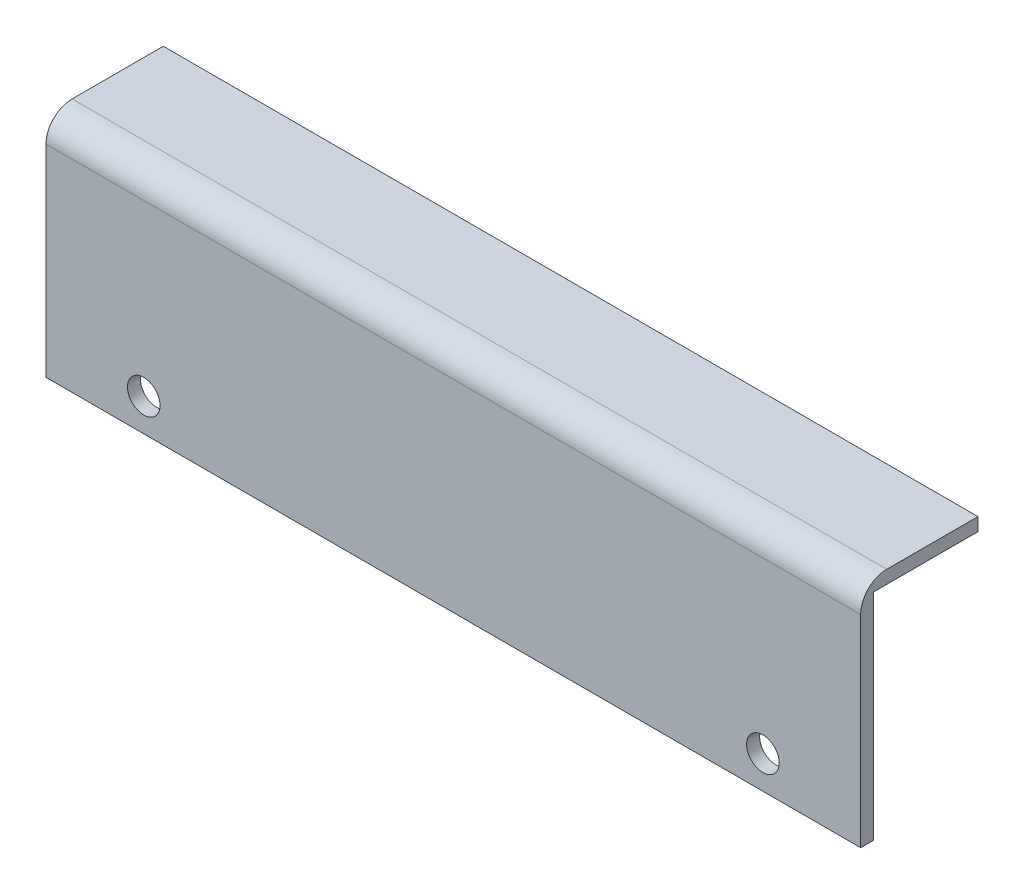
ISO-10303-21;
HEADER;
FILE_DESCRIPTION(('STEP AP214'),'2;1');
FILE_NAME('part.step','',(''),(''),'','','');
FILE_SCHEMA(('AUTOMOTIVE_DESIGN { 1 0 10303 214 1 1 1 1 }'));
ENDSEC;
DATA;
#1=APPLICATION_CONTEXT('core data for automotive mechanical design processes');
#2=APPLICATION_PROTOCOL_DEFINITION('international standard','automotive_design',2000,#1);
#3=PRODUCT_CONTEXT('',#1,'mechanical');
#4=PRODUCT('Part','Part','',(#3));
#5=PRODUCT_RELATED_PRODUCT_CATEGORY('part','',(#4));
#6=PRODUCT_DEFINITION_FORMATION('','',#4);
#7=PRODUCT_DEFINITION_CONTEXT('part definition',#1,'design');
#8=PRODUCT_DEFINITION('design','',#6,#7);
#9=PRODUCT_DEFINITION_SHAPE('','',#8);
#10=(LENGTH_UNIT() NAMED_UNIT(*) SI_UNIT(.MILLI.,.METRE.));
#11=(NAMED_UNIT(*) PLANE_ANGLE_UNIT() SI_UNIT($,.RADIAN.));
#12=(NAMED_UNIT(*) SI_UNIT($,.STERADIAN.) SOLID_ANGLE_UNIT());
#13=UNCERTAINTY_MEASURE_WITH_UNIT(LENGTH_MEASURE(1.E-05),#10,'distance_accuracy_value','');
#14=(GEOMETRIC_REPRESENTATION_CONTEXT(3) GLOBAL_UNCERTAINTY_ASSIGNED_CONTEXT((#13)) GLOBAL_UNIT_ASSIGNED_CONTEXT((#10,
#11,#12)) REPRESENTATION_CONTEXT('',''));
#15=CARTESIAN_POINT('',(0.,0.,0.));
#16=DIRECTION('',(0.,0.,1.));
#17=DIRECTION('',(1.,0.,0.));
#18=AXIS2_PLACEMENT_3D('',#15,#16,#17);
#19=CARTESIAN_POINT('',(125.,16.7867758305788,-1.14164631227231));
#20=DIRECTION('',(0.,0.,1.));
#21=DIRECTION('',(0.,-1.,0.));
#22=AXIS2_PLACEMENT_3D('',#19,#20,#21);
#23=PLANE('',#22);
#24=CARTESIAN_POINT('',(110.,-11.2132241694212,-1.14164631227231));
#25=DIRECTION('',(0.,0.,-1.));
#26=DIRECTION('',(0.,1.,0.));
#27=AXIS2_PLACEMENT_3D('',#24,#25,#26);
#28=CIRCLE('',#27,2.49999999999999);
#29=CARTESIAN_POINT('',(110.,-8.71322416942122,-1.14164631227231));
#30=VERTEX_POINT('',#29);
#31=EDGE_CURVE('E131',#30,#30,#28,.T.);
#32=ORIENTED_EDGE('',*,*,#31,.F.);
#33=EDGE_LOOP('',(#32));
#34=FACE_BOUND('',#33,.T.);
#35=CARTESIAN_POINT('',(15.,-11.2132241694212,-1.14164631227231));
#36=DIRECTION('',(0.,0.,-1.));
#37=DIRECTION('',(0.,1.,0.));
#38=AXIS2_PLACEMENT_3D('',#35,#36,#37);
#39=CIRCLE('',#38,2.5);
#40=CARTESIAN_POINT('',(15.,-8.71322416942121,-1.14164631227231));
#41=VERTEX_POINT('',#40);
#42=EDGE_CURVE('E136',#41,#41,#39,.T.);
#43=ORIENTED_EDGE('',*,*,#42,.F.);
#44=EDGE_LOOP('',(#43));
#45=FACE_BOUND('',#44,.T.);
#46=DIRECTION('',(0.,1.,0.));
#47=VECTOR('',#46,1.);
#48=CARTESIAN_POINT('',(0.,16.7867758305788,-1.14164631227231));
#49=LINE('',#48,#47);
#50=CARTESIAN_POINT('',(0.,-16.2132241694212,-1.14164631227231));
#51=VERTEX_POINT('',#50);
#52=CARTESIAN_POINT('',(0.,16.7867758305788,-1.14164631227231));
#53=VERTEX_POINT('',#52);
#54=EDGE_CURVE('E119',#51,#53,#49,.T.);
#55=ORIENTED_EDGE('',*,*,#54,.T.);
#56=DIRECTION('',(-1.,0.,0.));
#57=VECTOR('',#56,1.);
#58=CARTESIAN_POINT('',(125.,16.7867758305788,-1.14164631227231));
#59=LINE('',#58,#57);
#60=CARTESIAN_POINT('',(125.,16.7867758305788,-1.14164631227231));
#61=VERTEX_POINT('',#60);
#62=EDGE_CURVE('E100',#61,#53,#59,.T.);
#63=ORIENTED_EDGE('',*,*,#62,.F.);
#64=DIRECTION('',(0.,1.,0.));
#65=VECTOR('',#64,1.);
#66=CARTESIAN_POINT('',(125.,16.7867758305788,-1.14164631227231));
#67=LINE('',#66,#65);
#68=CARTESIAN_POINT('',(125.,-16.2132241694212,-1.14164631227231));
#69=VERTEX_POINT('',#68);
#70=EDGE_CURVE('E107',#69,#61,#67,.T.);
#71=ORIENTED_EDGE('',*,*,#70,.F.);
#72=DIRECTION('',(-1.,0.,0.));
#73=VECTOR('',#72,1.);
#74=CARTESIAN_POINT('',(125.,-16.2132241694212,-1.14164631227231));
#75=LINE('',#74,#73);
#76=EDGE_CURVE('E149',#69,#51,#75,.T.);
#77=ORIENTED_EDGE('',*,*,#76,.T.);
#78=EDGE_LOOP('',(#55,#63,#71,#77));
#79=FACE_BOUND('',#78,.T.);
#80=ADVANCED_FACE('F35',(#34,#45,#79),#23,.F.);
#81=CARTESIAN_POINT('',(125.,16.7867758305788,-1.14164631227231));
#82=DIRECTION('',(0.,1.,0.));
#83=DIRECTION('',(0.,0.,1.));
#84=AXIS2_PLACEMENT_3D('',#81,#82,#83);
#85=PLANE('',#84);
#86=DIRECTION('',(0.,0.,-1.));
#87=VECTOR('',#86,1.);
#88=CARTESIAN_POINT('',(0.,16.7867758305788,-1.14164631227231));
#89=LINE('',#88,#87);
#90=CARTESIAN_POINT('',(0.,16.7867758305788,-17.1416463122723));
#91=VERTEX_POINT('',#90);
#92=EDGE_CURVE('E151',#53,#91,#89,.T.);
#93=ORIENTED_EDGE('',*,*,#92,.T.);
#94=DIRECTION('',(-1.,0.,0.));
#95=VECTOR('',#94,1.);
#96=CARTESIAN_POINT('',(125.,16.7867758305788,-17.1416463122723));
#97=LINE('',#96,#95);
#98=CARTESIAN_POINT('',(125.,16.7867758305788,-17.1416463122723));
#99=VERTEX_POINT('',#98);
#100=EDGE_CURVE('E103',#99,#91,#97,.T.);
#101=ORIENTED_EDGE('',*,*,#100,.F.);
#102=DIRECTION('',(0.,0.,-1.));
#103=VECTOR('',#102,1.);
#104=CARTESIAN_POINT('',(125.,16.7867758305788,-1.14164631227231));
#105=LINE('',#104,#103);
#106=EDGE_CURVE('E96',#61,#99,#105,.T.);
#107=ORIENTED_EDGE('',*,*,#106,.F.);
#108=ORIENTED_EDGE('',*,*,#62,.T.);
#109=EDGE_LOOP('',(#93,#101,#107,#108));
#110=FACE_BOUND('',#109,.T.);
#111=ADVANCED_FACE('F98',(#110),#85,.F.);
#112=CARTESIAN_POINT('',(125.,18.7867758305788,-17.1416463122723));
#113=DIRECTION('',(0.,0.,1.));
#114=DIRECTION('',(1.,0.,0.));
#115=AXIS2_PLACEMENT_3D('',#112,#113,#114);
#116=PLANE('',#115);
#117=DIRECTION('',(0.,1.,0.));
#118=VECTOR('',#117,1.);
#119=CARTESIAN_POINT('',(0.,18.7867758305788,-17.1416463122723));
#120=LINE('',#119,#118);
#121=CARTESIAN_POINT('',(0.,18.7867758305788,-17.1416463122723));
#122=VERTEX_POINT('',#121);
#123=EDGE_CURVE('E153',#91,#122,#120,.T.);
#124=ORIENTED_EDGE('',*,*,#123,.T.);
#125=DIRECTION('',(-1.,0.,0.));
#126=VECTOR('',#125,1.);
#127=CARTESIAN_POINT('',(125.,18.7867758305788,-17.1416463122723));
#128=LINE('',#127,#126);
#129=CARTESIAN_POINT('',(125.,18.7867758305788,-17.1416463122723));
#130=VERTEX_POINT('',#129);
#131=EDGE_CURVE('E124',#130,#122,#128,.T.);
#132=ORIENTED_EDGE('',*,*,#131,.F.);
#133=DIRECTION('',(0.,1.,0.));
#134=VECTOR('',#133,1.);
#135=CARTESIAN_POINT('',(125.,18.7867758305788,-17.1416463122723));
#136=LINE('',#135,#134);
#137=EDGE_CURVE('E106',#99,#130,#136,.T.);
#138=ORIENTED_EDGE('',*,*,#137,.F.);
#139=ORIENTED_EDGE('',*,*,#100,.T.);
#140=EDGE_LOOP('',(#124,#132,#138,#139));
#141=FACE_BOUND('',#140,.T.);
#142=ADVANCED_FACE('F169',(#141),#116,.F.);
#143=CARTESIAN_POINT('',(125.,18.7867758305788,0.858353687727691));
#144=DIRECTION('',(0.,-1.,0.));
#145=DIRECTION('',(0.,0.,-1.));
#146=AXIS2_PLACEMENT_3D('',#143,#144,#145);
#147=PLANE('',#146);
#148=DIRECTION('',(0.,0.,1.));
#149=VECTOR('',#148,1.);
#150=CARTESIAN_POINT('',(0.,18.7867758305788,0.858353687727691));
#151=LINE('',#150,#149);
#152=CARTESIAN_POINT('',(0.,18.7867758305788,-3.14164631227231));
#153=VERTEX_POINT('',#152);
#154=EDGE_CURVE('E155',#122,#153,#151,.T.);
#155=ORIENTED_EDGE('',*,*,#154,.T.);
#156=DIRECTION('',(-1.,0.,0.));
#157=VECTOR('',#156,1.);
#158=CARTESIAN_POINT('',(125.,18.7867758305788,-3.14164631227231));
#159=LINE('',#158,#157);
#160=CARTESIAN_POINT('',(125.,18.7867758305788,-3.14164631227231));
#161=VERTEX_POINT('',#160);
#162=EDGE_CURVE('E44',#153,#161,#159,.F.);
#163=ORIENTED_EDGE('',*,*,#162,.T.);
#164=DIRECTION('',(0.,0.,1.));
#165=VECTOR('',#164,1.);
#166=CARTESIAN_POINT('',(125.,18.7867758305788,0.858353687727691));
#167=LINE('',#166,#165);
#168=EDGE_CURVE('E144',#130,#161,#167,.T.);
#169=ORIENTED_EDGE('',*,*,#168,.F.);
#170=ORIENTED_EDGE('',*,*,#131,.T.);
#171=EDGE_LOOP('',(#155,#163,#169,#170));
#172=FACE_BOUND('',#171,.T.);
#173=ADVANCED_FACE('F165',(#172),#147,.F.);
#174=CARTESIAN_POINT('',(125.,18.7867758305788,0.858353687727691));
#175=DIRECTION('',(0.,0.,-1.));
#176=DIRECTION('',(0.,1.,0.));
#177=AXIS2_PLACEMENT_3D('',#174,#175,#176);
#178=PLANE('',#177);
#179=CARTESIAN_POINT('',(110.,-11.2132241694212,0.858353687727686));
#180=DIRECTION('',(0.,0.,-1.));
#181=DIRECTION('',(0.,1.,0.));
#182=AXIS2_PLACEMENT_3D('',#179,#180,#181);
#183=CIRCLE('',#182,2.49999999999999);
#184=CARTESIAN_POINT('',(110.,-8.71322416942122,0.858353687727687));
#185=VERTEX_POINT('',#184);
#186=EDGE_CURVE('E39',#185,#185,#183,.T.);
#187=ORIENTED_EDGE('',*,*,#186,.T.);
#188=EDGE_LOOP('',(#187));
#189=FACE_BOUND('',#188,.T.);
#190=CARTESIAN_POINT('',(15.,-11.2132241694212,0.858353687727686));
#191=DIRECTION('',(0.,0.,-1.));
#192=DIRECTION('',(0.,1.,0.));
#193=AXIS2_PLACEMENT_3D('',#190,#191,#192);
#194=CIRCLE('',#193,2.5);
#195=CARTESIAN_POINT('',(15.,-8.71322416942121,0.858353687727687));
#196=VERTEX_POINT('',#195);
#197=EDGE_CURVE('E129',#196,#196,#194,.T.);
#198=ORIENTED_EDGE('',*,*,#197,.T.);
#199=EDGE_LOOP('',(#198));
#200=FACE_BOUND('',#199,.T.);
#201=DIRECTION('',(0.,-1.,0.));
#202=VECTOR('',#201,1.);
#203=CARTESIAN_POINT('',(125.,18.7867758305788,0.858353687727691));
#204=LINE('',#203,#202);
#205=CARTESIAN_POINT('',(125.,14.7867758305788,0.858353687727691));
#206=VERTEX_POINT('',#205);
#207=CARTESIAN_POINT('',(125.,-16.2132241694212,0.858353687727687));
#208=VERTEX_POINT('',#207);
#209=EDGE_CURVE('E146',#206,#208,#204,.T.);
#210=ORIENTED_EDGE('',*,*,#209,.F.);
#211=DIRECTION('',(-1.,0.,0.));
#212=VECTOR('',#211,1.);
#213=CARTESIAN_POINT('',(125.,14.7867758305788,0.858353687727691));
#214=LINE('',#213,#212);
#215=CARTESIAN_POINT('',(0.,14.7867758305788,0.858353687727691));
#216=VERTEX_POINT('',#215);
#217=EDGE_CURVE('E120',#206,#216,#214,.T.);
#218=ORIENTED_EDGE('',*,*,#217,.T.);
#219=DIRECTION('',(0.,-1.,0.));
#220=VECTOR('',#219,1.);
#221=CARTESIAN_POINT('',(0.,18.7867758305788,0.858353687727691));
#222=LINE('',#221,#220);
#223=CARTESIAN_POINT('',(0.,-16.2132241694212,0.858353687727687));
#224=VERTEX_POINT('',#223);
#225=EDGE_CURVE('E157',#216,#224,#222,.T.);
#226=ORIENTED_EDGE('',*,*,#225,.T.);
#227=DIRECTION('',(-1.,0.,0.));
#228=VECTOR('',#227,1.);
#229=CARTESIAN_POINT('',(125.,-16.2132241694212,0.858353687727687));
#230=LINE('',#229,#228);
#231=EDGE_CURVE('E161',#208,#224,#230,.T.);
#232=ORIENTED_EDGE('',*,*,#231,.F.);
#233=EDGE_LOOP('',(#210,#218,#226,#232));
#234=FACE_BOUND('',#233,.T.);
#235=ADVANCED_FACE('F175',(#189,#200,#234),#178,.F.);
#236=CARTESIAN_POINT('',(125.,-16.2132241694212,0.858353687727687));
#237=DIRECTION('',(0.,1.,0.));
#238=DIRECTION('',(0.,0.,1.));
#239=AXIS2_PLACEMENT_3D('',#236,#237,#238);
#240=PLANE('',#239);
#241=DIRECTION('',(0.,0.,-1.));
#242=VECTOR('',#241,1.);
#243=CARTESIAN_POINT('',(0.,-16.2132241694212,0.858353687727687));
#244=LINE('',#243,#242);
#245=EDGE_CURVE('E116',#224,#51,#244,.T.);
#246=ORIENTED_EDGE('',*,*,#245,.T.);
#247=ORIENTED_EDGE('',*,*,#76,.F.);
#248=DIRECTION('',(0.,0.,-1.));
#249=VECTOR('',#248,1.);
#250=CARTESIAN_POINT('',(125.,-16.2132241694212,0.858353687727687));
#251=LINE('',#250,#249);
#252=EDGE_CURVE('E112',#208,#69,#251,.T.);
#253=ORIENTED_EDGE('',*,*,#252,.F.);
#254=ORIENTED_EDGE('',*,*,#231,.T.);
#255=EDGE_LOOP('',(#246,#247,#253,#254));
#256=FACE_BOUND('',#255,.T.);
#257=ADVANCED_FACE('F179',(#256),#240,.F.);
#258=CARTESIAN_POINT('',(125.,0.,0.));
#259=DIRECTION('',(1.,0.,0.));
#260=DIRECTION('',(0.,0.,-1.));
#261=AXIS2_PLACEMENT_3D('',#258,#259,#260);
#262=PLANE('',#261);
#263=ORIENTED_EDGE('',*,*,#168,.T.);
#264=CARTESIAN_POINT('',(125.,14.7867758305788,-3.14164631227231));
#265=DIRECTION('',(1.,0.,0.));
#266=DIRECTION('',(0.,0.,-1.));
#267=AXIS2_PLACEMENT_3D('',#264,#265,#266);
#268=CIRCLE('',#267,4.);
#269=EDGE_CURVE('E11',#161,#206,#268,.T.);
#270=ORIENTED_EDGE('',*,*,#269,.T.);
#271=ORIENTED_EDGE('',*,*,#209,.T.);
#272=ORIENTED_EDGE('',*,*,#252,.T.);
#273=ORIENTED_EDGE('',*,*,#70,.T.);
#274=ORIENTED_EDGE('',*,*,#106,.T.);
#275=ORIENTED_EDGE('',*,*,#137,.T.);
#276=EDGE_LOOP('',(#263,#270,#271,#272,#273,#274,#275));
#277=FACE_BOUND('',#276,.T.);
#278=ADVANCED_FACE('F110',(#277),#262,.T.);
#279=CARTESIAN_POINT('',(0.,0.,0.));
#280=DIRECTION('',(1.,0.,0.));
#281=DIRECTION('',(0.,0.,-1.));
#282=AXIS2_PLACEMENT_3D('',#279,#280,#281);
#283=PLANE('',#282);
#284=ORIENTED_EDGE('',*,*,#225,.F.);
#285=CARTESIAN_POINT('',(0.,14.7867758305788,-3.14164631227231));
#286=DIRECTION('',(1.,0.,0.));
#287=DIRECTION('',(0.,0.,-1.));
#288=AXIS2_PLACEMENT_3D('',#285,#286,#287);
#289=CIRCLE('',#288,4.);
#290=EDGE_CURVE('E59',#216,#153,#289,.F.);
#291=ORIENTED_EDGE('',*,*,#290,.T.);
#292=ORIENTED_EDGE('',*,*,#154,.F.);
#293=ORIENTED_EDGE('',*,*,#123,.F.);
#294=ORIENTED_EDGE('',*,*,#92,.F.);
#295=ORIENTED_EDGE('',*,*,#54,.F.);
#296=ORIENTED_EDGE('',*,*,#245,.F.);
#297=EDGE_LOOP('',(#284,#291,#292,#293,#294,#295,#296));
#298=FACE_BOUND('',#297,.T.);
#299=ADVANCED_FACE('F168',(#298),#283,.F.);
#300=CARTESIAN_POINT('',(125.,14.7867758305788,-3.14164631227231));
#301=DIRECTION('',(-1.,0.,0.));
#302=DIRECTION('',(0.,0.,1.));
#303=AXIS2_PLACEMENT_3D('',#300,#301,#302);
#304=CYLINDRICAL_SURFACE('',#303,4.);
#305=ORIENTED_EDGE('',*,*,#269,.F.);
#306=ORIENTED_EDGE('',*,*,#162,.F.);
#307=ORIENTED_EDGE('',*,*,#290,.F.);
#308=ORIENTED_EDGE('',*,*,#217,.F.);
#309=EDGE_LOOP('',(#305,#306,#307,#308));
#310=FACE_BOUND('',#309,.T.);
#311=ADVANCED_FACE('F37',(#310),#304,.T.);
#312=CARTESIAN_POINT('',(15.,-11.2132241694212,123.858353687728));
#313=DIRECTION('',(0.,0.,-1.));
#314=DIRECTION('',(0.,1.,0.));
#315=AXIS2_PLACEMENT_3D('',#312,#313,#314);
#316=CYLINDRICAL_SURFACE('',#315,2.5);
#317=ORIENTED_EDGE('',*,*,#42,.T.);
#318=EDGE_LOOP('',(#317));
#319=FACE_BOUND('',#318,.T.);
#320=ORIENTED_EDGE('',*,*,#197,.F.);
#321=EDGE_LOOP('',(#320));
#322=FACE_BOUND('',#321,.T.);
#323=ADVANCED_FACE('F230',(#319,#322),#316,.F.);
#324=CARTESIAN_POINT('',(110.,-11.2132241694212,123.858353687728));
#325=DIRECTION('',(0.,0.,-1.));
#326=DIRECTION('',(0.,1.,0.));
#327=AXIS2_PLACEMENT_3D('',#324,#325,#326);
#328=CYLINDRICAL_SURFACE('',#327,2.49999999999999);
#329=ORIENTED_EDGE('',*,*,#31,.T.);
#330=EDGE_LOOP('',(#329));
#331=FACE_BOUND('',#330,.T.);
#332=ORIENTED_EDGE('',*,*,#186,.F.);
#333=EDGE_LOOP('',(#332));
#334=FACE_BOUND('',#333,.T.);
#335=ADVANCED_FACE('F235',(#331,#334),#328,.F.);
#336=CLOSED_SHELL('',(#80,#111,#142,#173,#235,#257,#278,#299,#311,#323,#335));
#337=MANIFOLD_SOLID_BREP('B2',#336);
#338=ADVANCED_BREP_SHAPE_REPRESENTATION('',(#18,#337),#14);
#339=SHAPE_DEFINITION_REPRESENTATION(#9,#338);
ENDSEC;
END-ISO-10303-21;
